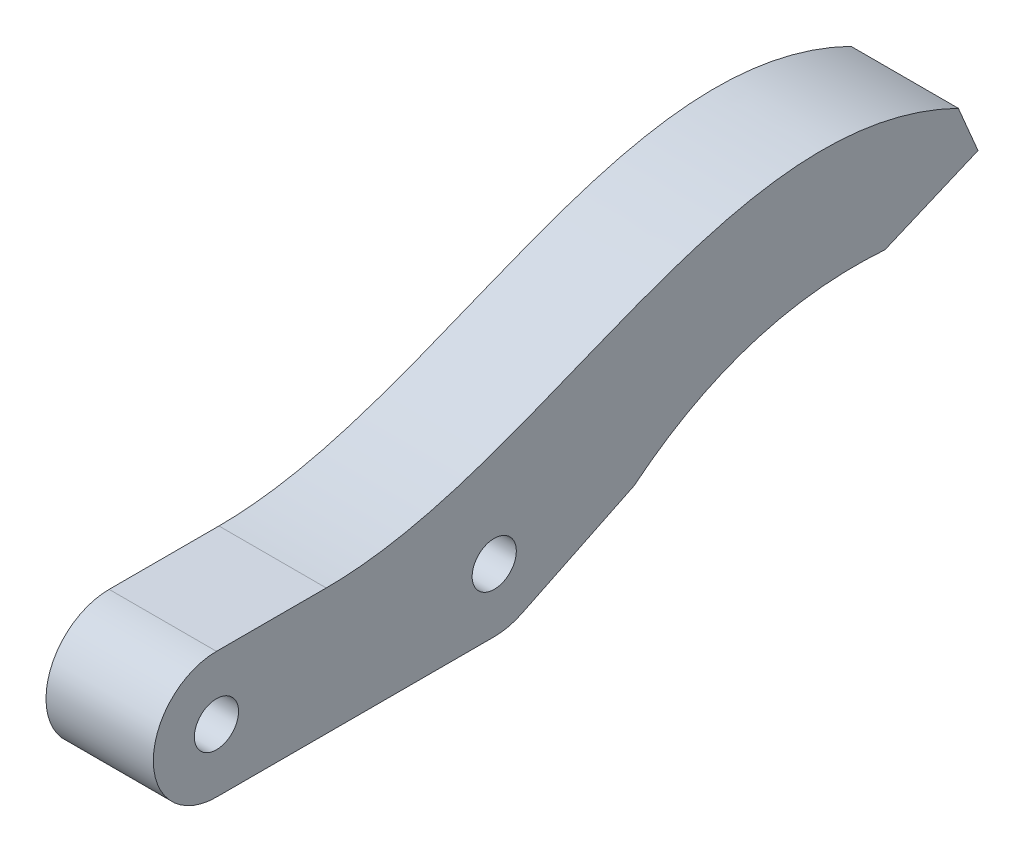
ISO-10303-21;
HEADER;
FILE_DESCRIPTION(('STEP AP214'),'2;1');
FILE_NAME('part.step','',(''),(''),'','','');
FILE_SCHEMA(('AUTOMOTIVE_DESIGN { 1 0 10303 214 1 1 1 1 }'));
ENDSEC;
DATA;
#1=APPLICATION_CONTEXT('core data for automotive mechanical design processes');
#2=APPLICATION_PROTOCOL_DEFINITION('international standard','automotive_design',2000,#1);
#3=PRODUCT_CONTEXT('',#1,'mechanical');
#4=PRODUCT('Part','Part','',(#3));
#5=PRODUCT_RELATED_PRODUCT_CATEGORY('part','',(#4));
#6=PRODUCT_DEFINITION_FORMATION('','',#4);
#7=PRODUCT_DEFINITION_CONTEXT('part definition',#1,'design');
#8=PRODUCT_DEFINITION('design','',#6,#7);
#9=PRODUCT_DEFINITION_SHAPE('','',#8);
#10=(LENGTH_UNIT() NAMED_UNIT(*) SI_UNIT(.MILLI.,.METRE.));
#11=(NAMED_UNIT(*) PLANE_ANGLE_UNIT() SI_UNIT($,.RADIAN.));
#12=(NAMED_UNIT(*) SI_UNIT($,.STERADIAN.) SOLID_ANGLE_UNIT());
#13=UNCERTAINTY_MEASURE_WITH_UNIT(LENGTH_MEASURE(1.E-05),#10,'distance_accuracy_value','');
#14=(GEOMETRIC_REPRESENTATION_CONTEXT(3) GLOBAL_UNCERTAINTY_ASSIGNED_CONTEXT((#13)) GLOBAL_UNIT_ASSIGNED_CONTEXT((#10,
#11,#12)) REPRESENTATION_CONTEXT('',''));
#15=CARTESIAN_POINT('',(0.,0.,0.));
#16=DIRECTION('',(0.,0.,1.));
#17=DIRECTION('',(1.,0.,0.));
#18=AXIS2_PLACEMENT_3D('',#15,#16,#17);
#19=CARTESIAN_POINT('',(8.5,5.,-27.));
#20=DIRECTION('',(-1.,0.,0.));
#21=DIRECTION('',(0.,0.,1.));
#22=AXIS2_PLACEMENT_3D('',#19,#20,#21);
#23=CYLINDRICAL_SURFACE('',#22,5.);
#24=DIRECTION('',(1.,0.,0.));
#25=VECTOR('',#24,1.);
#26=CARTESIAN_POINT('',(0.,0.502127655445501,-29.1838370754458));
#27=LINE('',#26,#25);
#28=CARTESIAN_POINT('',(0.,0.502127655445501,-29.1838370754458));
#29=VERTEX_POINT('',#28);
#30=CARTESIAN_POINT('',(8.5,0.502127655445501,-29.1838370754458));
#31=VERTEX_POINT('',#30);
#32=EDGE_CURVE('E211',#29,#31,#27,.T.);
#33=ORIENTED_EDGE('',*,*,#32,.T.);
#34=CARTESIAN_POINT('',(8.5,5.,-27.));
#35=DIRECTION('',(1.,0.,0.));
#36=DIRECTION('',(0.,0.,-1.));
#37=AXIS2_PLACEMENT_3D('',#34,#35,#36);
#38=CIRCLE('',#37,5.);
#39=CARTESIAN_POINT('',(8.5,0.,-27.));
#40=VERTEX_POINT('',#39);
#41=EDGE_CURVE('E228',#40,#31,#38,.T.);
#42=ORIENTED_EDGE('',*,*,#41,.F.);
#43=DIRECTION('',(-1.,0.,0.));
#44=VECTOR('',#43,1.);
#45=CARTESIAN_POINT('',(8.5,0.,-27.));
#46=LINE('',#45,#44);
#47=CARTESIAN_POINT('',(0.,0.,-27.));
#48=VERTEX_POINT('',#47);
#49=EDGE_CURVE('E239',#40,#48,#46,.T.);
#50=ORIENTED_EDGE('',*,*,#49,.T.);
#51=CARTESIAN_POINT('',(0.,5.,-27.));
#52=DIRECTION('',(1.,0.,0.));
#53=DIRECTION('',(0.,0.,-1.));
#54=AXIS2_PLACEMENT_3D('',#51,#52,#53);
#55=CIRCLE('',#54,5.);
#56=EDGE_CURVE('E246',#48,#29,#55,.T.);
#57=ORIENTED_EDGE('',*,*,#56,.T.);
#58=EDGE_LOOP('',(#33,#42,#50,#57));
#59=FACE_BOUND('',#58,.T.);
#60=ADVANCED_FACE('F49',(#59),#23,.T.);
#61=CARTESIAN_POINT('',(8.5,10.,0.));
#62=DIRECTION('',(0.,1.,0.));
#63=DIRECTION('',(0.,0.,1.));
#64=AXIS2_PLACEMENT_3D('',#61,#62,#63);
#65=PLANE('',#64);
#66=DIRECTION('',(1.,0.,0.));
#67=VECTOR('',#66,1.);
#68=CARTESIAN_POINT('',(0.,10.,-13.6949747586838));
#69=LINE('',#68,#67);
#70=CARTESIAN_POINT('',(0.,10.,-13.6949747586838));
#71=VERTEX_POINT('',#70);
#72=CARTESIAN_POINT('',(8.5,10.,-13.6949747586838));
#73=VERTEX_POINT('',#72);
#74=EDGE_CURVE('E141',#71,#73,#69,.T.);
#75=ORIENTED_EDGE('',*,*,#74,.F.);
#76=DIRECTION('',(0.,0.,-1.));
#77=VECTOR('',#76,1.);
#78=CARTESIAN_POINT('',(0.,10.,0.));
#79=LINE('',#78,#77);
#80=CARTESIAN_POINT('',(0.,10.,-5.));
#81=VERTEX_POINT('',#80);
#82=EDGE_CURVE('E152',#81,#71,#79,.T.);
#83=ORIENTED_EDGE('',*,*,#82,.F.);
#84=DIRECTION('',(-1.,0.,0.));
#85=VECTOR('',#84,1.);
#86=CARTESIAN_POINT('',(8.5,10.,-5.));
#87=LINE('',#86,#85);
#88=CARTESIAN_POINT('',(8.5,10.,-5.));
#89=VERTEX_POINT('',#88);
#90=EDGE_CURVE('E11',#89,#81,#87,.T.);
#91=ORIENTED_EDGE('',*,*,#90,.F.);
#92=DIRECTION('',(0.,0.,-1.));
#93=VECTOR('',#92,1.);
#94=CARTESIAN_POINT('',(8.5,10.,0.));
#95=LINE('',#94,#93);
#96=EDGE_CURVE('E209',#89,#73,#95,.T.);
#97=ORIENTED_EDGE('',*,*,#96,.T.);
#98=EDGE_LOOP('',(#75,#83,#91,#97));
#99=FACE_BOUND('',#98,.T.);
#100=ADVANCED_FACE('F51',(#99),#65,.T.);
#101=CARTESIAN_POINT('',(8.5,5.,-5.));
#102=DIRECTION('',(-1.,0.,0.));
#103=DIRECTION('',(0.,0.,1.));
#104=AXIS2_PLACEMENT_3D('',#101,#102,#103);
#105=CYLINDRICAL_SURFACE('',#104,5.);
#106=CARTESIAN_POINT('',(0.,5.,-5.));
#107=DIRECTION('',(1.,0.,0.));
#108=DIRECTION('',(0.,0.,-1.));
#109=AXIS2_PLACEMENT_3D('',#106,#107,#108);
#110=CIRCLE('',#109,5.);
#111=CARTESIAN_POINT('',(0.,0.,-5.));
#112=VERTEX_POINT('',#111);
#113=EDGE_CURVE('E80',#81,#112,#110,.T.);
#114=ORIENTED_EDGE('',*,*,#113,.T.);
#115=DIRECTION('',(-1.,0.,0.));
#116=VECTOR('',#115,1.);
#117=CARTESIAN_POINT('',(8.5,0.,-5.));
#118=LINE('',#117,#116);
#119=CARTESIAN_POINT('',(8.5,0.,-5.));
#120=VERTEX_POINT('',#119);
#121=EDGE_CURVE('E59',#120,#112,#118,.T.);
#122=ORIENTED_EDGE('',*,*,#121,.F.);
#123=CARTESIAN_POINT('',(8.5,5.,-5.));
#124=DIRECTION('',(1.,0.,0.));
#125=DIRECTION('',(0.,0.,-1.));
#126=AXIS2_PLACEMENT_3D('',#123,#124,#125);
#127=CIRCLE('',#126,5.);
#128=EDGE_CURVE('E222',#89,#120,#127,.T.);
#129=ORIENTED_EDGE('',*,*,#128,.F.);
#130=ORIENTED_EDGE('',*,*,#90,.T.);
#131=EDGE_LOOP('',(#114,#122,#129,#130));
#132=FACE_BOUND('',#131,.T.);
#133=ADVANCED_FACE('F201',(#132),#105,.T.);
#134=CARTESIAN_POINT('',(8.5,0.,0.));
#135=DIRECTION('',(0.,1.,0.));
#136=DIRECTION('',(0.,0.,1.));
#137=AXIS2_PLACEMENT_3D('',#134,#135,#136);
#138=PLANE('',#137);
#139=DIRECTION('',(0.,0.,-1.));
#140=VECTOR('',#139,1.);
#141=CARTESIAN_POINT('',(0.,0.,0.));
#142=LINE('',#141,#140);
#143=EDGE_CURVE('E85',#112,#48,#142,.T.);
#144=ORIENTED_EDGE('',*,*,#143,.T.);
#145=ORIENTED_EDGE('',*,*,#49,.F.);
#146=DIRECTION('',(0.,0.,-1.));
#147=VECTOR('',#146,1.);
#148=CARTESIAN_POINT('',(8.5,0.,0.));
#149=LINE('',#148,#147);
#150=EDGE_CURVE('E67',#120,#40,#149,.T.);
#151=ORIENTED_EDGE('',*,*,#150,.F.);
#152=ORIENTED_EDGE('',*,*,#121,.T.);
#153=EDGE_LOOP('',(#144,#145,#151,#152));
#154=FACE_BOUND('',#153,.T.);
#155=ADVANCED_FACE('F195',(#154),#138,.F.);
#156=CARTESIAN_POINT('',(8.5,5.,-5.));
#157=DIRECTION('',(-1.,0.,0.));
#158=DIRECTION('',(0.,0.,1.));
#159=AXIS2_PLACEMENT_3D('',#156,#157,#158);
#160=CYLINDRICAL_SURFACE('',#159,1.75);
#161=CARTESIAN_POINT('',(8.5,5.,-5.));
#162=DIRECTION('',(1.,0.,0.));
#163=DIRECTION('',(0.,0.,-1.));
#164=AXIS2_PLACEMENT_3D('',#161,#162,#163);
#165=CIRCLE('',#164,1.75);
#166=CARTESIAN_POINT('',(8.5,5.,-6.75));
#167=VERTEX_POINT('',#166);
#168=EDGE_CURVE('E231',#167,#167,#165,.T.);
#169=ORIENTED_EDGE('',*,*,#168,.T.);
#170=EDGE_LOOP('',(#169));
#171=FACE_BOUND('',#170,.T.);
#172=CARTESIAN_POINT('',(0.,5.,-5.));
#173=DIRECTION('',(1.,0.,0.));
#174=DIRECTION('',(0.,0.,-1.));
#175=AXIS2_PLACEMENT_3D('',#172,#173,#174);
#176=CIRCLE('',#175,1.75);
#177=CARTESIAN_POINT('',(0.,5.,-6.75));
#178=VERTEX_POINT('',#177);
#179=EDGE_CURVE('E250',#178,#178,#176,.T.);
#180=ORIENTED_EDGE('',*,*,#179,.F.);
#181=EDGE_LOOP('',(#180));
#182=FACE_BOUND('',#181,.T.);
#183=ADVANCED_FACE('F191',(#171,#182),#160,.F.);
#184=CARTESIAN_POINT('',(8.5,5.,-27.));
#185=DIRECTION('',(-1.,0.,0.));
#186=DIRECTION('',(0.,0.,1.));
#187=AXIS2_PLACEMENT_3D('',#184,#185,#186);
#188=CYLINDRICAL_SURFACE('',#187,1.75);
#189=CARTESIAN_POINT('',(8.5,5.,-27.));
#190=DIRECTION('',(1.,0.,0.));
#191=DIRECTION('',(0.,0.,-1.));
#192=AXIS2_PLACEMENT_3D('',#189,#190,#191);
#193=CIRCLE('',#192,1.75);
#194=CARTESIAN_POINT('',(8.5,5.,-28.75));
#195=VERTEX_POINT('',#194);
#196=EDGE_CURVE('E235',#195,#195,#193,.T.);
#197=ORIENTED_EDGE('',*,*,#196,.T.);
#198=EDGE_LOOP('',(#197));
#199=FACE_BOUND('',#198,.T.);
#200=CARTESIAN_POINT('',(0.,5.,-27.));
#201=DIRECTION('',(1.,0.,0.));
#202=DIRECTION('',(0.,0.,-1.));
#203=AXIS2_PLACEMENT_3D('',#200,#201,#202);
#204=CIRCLE('',#203,1.75);
#205=CARTESIAN_POINT('',(0.,5.,-28.75));
#206=VERTEX_POINT('',#205);
#207=EDGE_CURVE('E223',#206,#206,#204,.T.);
#208=ORIENTED_EDGE('',*,*,#207,.F.);
#209=EDGE_LOOP('',(#208));
#210=FACE_BOUND('',#209,.T.);
#211=ADVANCED_FACE('F186',(#199,#210),#188,.F.);
#212=CARTESIAN_POINT('',(8.5,0.,0.));
#213=DIRECTION('',(1.,0.,0.));
#214=DIRECTION('',(0.,0.,-1.));
#215=AXIS2_PLACEMENT_3D('',#212,#213,#214);
#216=PLANE('',#215);
#217=ORIENTED_EDGE('',*,*,#96,.F.);
#218=ORIENTED_EDGE('',*,*,#128,.T.);
#219=ORIENTED_EDGE('',*,*,#150,.T.);
#220=ORIENTED_EDGE('',*,*,#41,.T.);
#221=DIRECTION('',(0.,0.436767415089167,-0.8995744689109));
#222=VECTOR('',#221,1.);
#223=CARTESIAN_POINT('',(8.5,-11.0601312365663,-5.36998891997289));
#224=LINE('',#223,#222);
#225=CARTESIAN_POINT('',(8.5,4.82408407678908,-38.0854206599091));
#226=VERTEX_POINT('',#225);
#227=EDGE_CURVE('E268',#31,#226,#224,.T.);
#228=ORIENTED_EDGE('',*,*,#227,.T.);
#229=CARTESIAN_POINT('',(8.5,4.82408407678908,-38.0854206599091));
#230=CARTESIAN_POINT('',(8.5,11.8952224566425,-46.7975095094647));
#231=CARTESIAN_POINT('',(8.5,11.0678436667493,-57.9480004086976));
#232=B_SPLINE_CURVE_WITH_KNOTS('',2,(#229,#230,#231),.UNSPECIFIED.,.F.,.F.,(3,3),(0.,1.),.UNSPECIFIED.);
#233=CARTESIAN_POINT('',(8.5,11.0678436667493,-57.9480004086976));
#234=VERTEX_POINT('',#233);
#235=EDGE_CURVE('E164',#226,#234,#232,.T.);
#236=ORIENTED_EDGE('',*,*,#235,.T.);
#237=DIRECTION('',(0.,0.39020935118337,-0.920726160293631));
#238=VECTOR('',#237,1.);
#239=CARTESIAN_POINT('',(8.5,-11.4367064909869,-4.84694582599828));
#240=LINE('',#239,#238);
#241=CARTESIAN_POINT('',(8.5,14.1895184762162,-65.3138096910467));
#242=VERTEX_POINT('',#241);
#243=EDGE_CURVE('E159',#234,#242,#240,.T.);
#244=ORIENTED_EDGE('',*,*,#243,.T.);
#245=DIRECTION('',(0.,0.920726160293631,0.39020935118337));
#246=VECTOR('',#245,1.);
#247=CARTESIAN_POINT('',(8.5,25.6262249672031,-60.4668638650484));
#248=LINE('',#247,#246);
#249=CARTESIAN_POINT('',(8.5,17.8724231173908,-63.7529722863132));
#250=VERTEX_POINT('',#249);
#251=EDGE_CURVE('E278',#242,#250,#248,.T.);
#252=ORIENTED_EDGE('',*,*,#251,.T.);
#253=CARTESIAN_POINT('',(8.5,17.8724231173908,-63.7529722863132));
#254=CARTESIAN_POINT('',(8.5,26.563787962677,-45.9288826779558));
#255=CARTESIAN_POINT('',(8.5,10.,-31.059268620705));
#256=CARTESIAN_POINT('',(8.5,10.,-13.6949747586838));
#257=B_SPLINE_CURVE_WITH_KNOTS('',3,(#253,#254,#255,#256),.UNSPECIFIED.,.F.,.F.,(4,4),(0.,1.),.UNSPECIFIED.);
#258=EDGE_CURVE('E135',#250,#73,#257,.T.);
#259=ORIENTED_EDGE('',*,*,#258,.T.);
#260=EDGE_LOOP('',(#217,#218,#219,#220,#228,#236,#244,#252,#259));
#261=FACE_BOUND('',#260,.T.);
#262=ORIENTED_EDGE('',*,*,#168,.F.);
#263=EDGE_LOOP('',(#262));
#264=FACE_BOUND('',#263,.T.);
#265=ORIENTED_EDGE('',*,*,#196,.F.);
#266=EDGE_LOOP('',(#265));
#267=FACE_BOUND('',#266,.T.);
#268=ADVANCED_FACE('F183',(#261,#264,#267),#216,.T.);
#269=CARTESIAN_POINT('',(0.,0.,0.));
#270=DIRECTION('',(1.,0.,0.));
#271=DIRECTION('',(0.,0.,-1.));
#272=AXIS2_PLACEMENT_3D('',#269,#270,#271);
#273=PLANE('',#272);
#274=ORIENTED_EDGE('',*,*,#82,.T.);
#275=CARTESIAN_POINT('',(0.,17.8724231173908,-63.7529722863132));
#276=CARTESIAN_POINT('',(0.,26.563787962677,-45.9288826779558));
#277=CARTESIAN_POINT('',(0.,10.,-31.059268620705));
#278=CARTESIAN_POINT('',(0.,10.,-13.6949747586838));
#279=B_SPLINE_CURVE_WITH_KNOTS('',3,(#275,#276,#277,#278),.UNSPECIFIED.,.F.,.F.,(4,4),(0.,1.),.UNSPECIFIED.);
#280=CARTESIAN_POINT('',(0.,17.8724231173908,-63.7529722863132));
#281=VERTEX_POINT('',#280);
#282=EDGE_CURVE('E132',#281,#71,#279,.T.);
#283=ORIENTED_EDGE('',*,*,#282,.F.);
#284=DIRECTION('',(0.,0.920726160293631,0.39020935118337));
#285=VECTOR('',#284,1.);
#286=CARTESIAN_POINT('',(0.,25.6262249672031,-60.4668638650484));
#287=LINE('',#286,#285);
#288=CARTESIAN_POINT('',(0.,14.1895184762162,-65.3138096910467));
#289=VERTEX_POINT('',#288);
#290=EDGE_CURVE('E150',#289,#281,#287,.T.);
#291=ORIENTED_EDGE('',*,*,#290,.F.);
#292=DIRECTION('',(0.,0.39020935118337,-0.920726160293631));
#293=VECTOR('',#292,1.);
#294=CARTESIAN_POINT('',(0.,-11.4367064909869,-4.84694582599828));
#295=LINE('',#294,#293);
#296=CARTESIAN_POINT('',(0.,11.0678436667493,-57.9480004086976));
#297=VERTEX_POINT('',#296);
#298=EDGE_CURVE('E142',#297,#289,#295,.T.);
#299=ORIENTED_EDGE('',*,*,#298,.F.);
#300=CARTESIAN_POINT('',(0.,4.82408407678908,-38.0854206599091));
#301=CARTESIAN_POINT('',(0.,11.8952224566425,-46.7975095094647));
#302=CARTESIAN_POINT('',(0.,11.0678436667493,-57.9480004086976));
#303=B_SPLINE_CURVE_WITH_KNOTS('',2,(#300,#301,#302),.UNSPECIFIED.,.F.,.F.,(3,3),(0.,1.),.UNSPECIFIED.);
#304=CARTESIAN_POINT('',(0.,4.82408407678908,-38.0854206599091));
#305=VERTEX_POINT('',#304);
#306=EDGE_CURVE('E298',#305,#297,#303,.T.);
#307=ORIENTED_EDGE('',*,*,#306,.F.);
#308=DIRECTION('',(0.,0.436767415089167,-0.8995744689109));
#309=VECTOR('',#308,1.);
#310=CARTESIAN_POINT('',(0.,-11.0601312365663,-5.36998891997289));
#311=LINE('',#310,#309);
#312=EDGE_CURVE('E154',#29,#305,#311,.T.);
#313=ORIENTED_EDGE('',*,*,#312,.F.);
#314=ORIENTED_EDGE('',*,*,#56,.F.);
#315=ORIENTED_EDGE('',*,*,#143,.F.);
#316=ORIENTED_EDGE('',*,*,#113,.F.);
#317=EDGE_LOOP('',(#274,#283,#291,#299,#307,#313,#314,#315,#316));
#318=FACE_BOUND('',#317,.T.);
#319=ORIENTED_EDGE('',*,*,#179,.T.);
#320=EDGE_LOOP('',(#319));
#321=FACE_BOUND('',#320,.T.);
#322=ORIENTED_EDGE('',*,*,#207,.T.);
#323=EDGE_LOOP('',(#322));
#324=FACE_BOUND('',#323,.T.);
#325=ADVANCED_FACE('F147',(#318,#321,#324),#273,.F.);
#326=CARTESIAN_POINT('',(0.,25.6262249672031,-60.4668638650484));
#327=DIRECTION('',(0.,0.39020935118337,-0.920726160293631));
#328=DIRECTION('',(0.,0.920726160293631,0.39020935118337));
#329=AXIS2_PLACEMENT_3D('',#326,#327,#328);
#330=PLANE('',#329);
#331=ORIENTED_EDGE('',*,*,#251,.F.);
#332=DIRECTION('',(1.,0.,0.));
#333=VECTOR('',#332,1.);
#334=CARTESIAN_POINT('',(0.,14.1895184762162,-65.3138096910467));
#335=LINE('',#334,#333);
#336=EDGE_CURVE('E157',#289,#242,#335,.T.);
#337=ORIENTED_EDGE('',*,*,#336,.F.);
#338=ORIENTED_EDGE('',*,*,#290,.T.);
#339=DIRECTION('',(1.,0.,0.));
#340=VECTOR('',#339,1.);
#341=CARTESIAN_POINT('',(0.,17.8724231173908,-63.7529722863132));
#342=LINE('',#341,#340);
#343=EDGE_CURVE('E129',#281,#250,#342,.T.);
#344=ORIENTED_EDGE('',*,*,#343,.T.);
#345=EDGE_LOOP('',(#331,#337,#338,#344));
#346=FACE_BOUND('',#345,.T.);
#347=ADVANCED_FACE('F156',(#346),#330,.T.);
#348=CARTESIAN_POINT('',(0.,-11.4367064909869,-4.84694582599828));
#349=DIRECTION('',(0.,-0.920726160293631,-0.39020935118337));
#350=DIRECTION('',(0.,0.39020935118337,-0.920726160293631));
#351=AXIS2_PLACEMENT_3D('',#348,#349,#350);
#352=PLANE('',#351);
#353=ORIENTED_EDGE('',*,*,#243,.F.);
#354=DIRECTION('',(1.,0.,0.));
#355=VECTOR('',#354,1.);
#356=CARTESIAN_POINT('',(0.,11.0678436667493,-57.9480004086976));
#357=LINE('',#356,#355);
#358=EDGE_CURVE('E291',#297,#234,#357,.T.);
#359=ORIENTED_EDGE('',*,*,#358,.F.);
#360=ORIENTED_EDGE('',*,*,#298,.T.);
#361=ORIENTED_EDGE('',*,*,#336,.T.);
#362=EDGE_LOOP('',(#353,#359,#360,#361));
#363=FACE_BOUND('',#362,.T.);
#364=ADVANCED_FACE('F182',(#363),#352,.T.);
#365=DIRECTION('',(1.,0.,0.));
#366=VECTOR('',#365,1.);
#367=SURFACE_OF_LINEAR_EXTRUSION('',#303,#366);
#368=ORIENTED_EDGE('',*,*,#235,.F.);
#369=DIRECTION('',(1.,0.,0.));
#370=VECTOR('',#369,1.);
#371=CARTESIAN_POINT('',(0.,4.82408407678908,-38.0854206599091));
#372=LINE('',#371,#370);
#373=EDGE_CURVE('E216',#305,#226,#372,.T.);
#374=ORIENTED_EDGE('',*,*,#373,.F.);
#375=ORIENTED_EDGE('',*,*,#306,.T.);
#376=ORIENTED_EDGE('',*,*,#358,.T.);
#377=EDGE_LOOP('',(#368,#374,#375,#376));
#378=FACE_BOUND('',#377,.T.);
#379=ADVANCED_FACE('F297',(#378),#367,.T.);
#380=CARTESIAN_POINT('',(0.,-11.0601312365663,-5.36998891997289));
#381=DIRECTION('',(0.,-0.8995744689109,-0.436767415089167));
#382=DIRECTION('',(0.,0.436767415089167,-0.8995744689109));
#383=AXIS2_PLACEMENT_3D('',#380,#381,#382);
#384=PLANE('',#383);
#385=ORIENTED_EDGE('',*,*,#227,.F.);
#386=ORIENTED_EDGE('',*,*,#32,.F.);
#387=ORIENTED_EDGE('',*,*,#312,.T.);
#388=ORIENTED_EDGE('',*,*,#373,.T.);
#389=EDGE_LOOP('',(#385,#386,#387,#388));
#390=FACE_BOUND('',#389,.T.);
#391=ADVANCED_FACE('F178',(#390),#384,.T.);
#392=DIRECTION('',(1.,0.,0.));
#393=VECTOR('',#392,1.);
#394=SURFACE_OF_LINEAR_EXTRUSION('',#279,#393);
#395=ORIENTED_EDGE('',*,*,#258,.F.);
#396=ORIENTED_EDGE('',*,*,#343,.F.);
#397=ORIENTED_EDGE('',*,*,#282,.T.);
#398=ORIENTED_EDGE('',*,*,#74,.T.);
#399=EDGE_LOOP('',(#395,#396,#397,#398));
#400=FACE_BOUND('',#399,.T.);
#401=ADVANCED_FACE('F131',(#400),#394,.T.);
#402=CLOSED_SHELL('',(#60,#100,#133,#155,#183,#211,#268,#325,#347,#364,#379,#391,#401));
#403=MANIFOLD_SOLID_BREP('B2',#402);
#404=ADVANCED_BREP_SHAPE_REPRESENTATION('',(#18,#403),#14);
#405=SHAPE_DEFINITION_REPRESENTATION(#9,#404);
ENDSEC;
END-ISO-10303-21;
